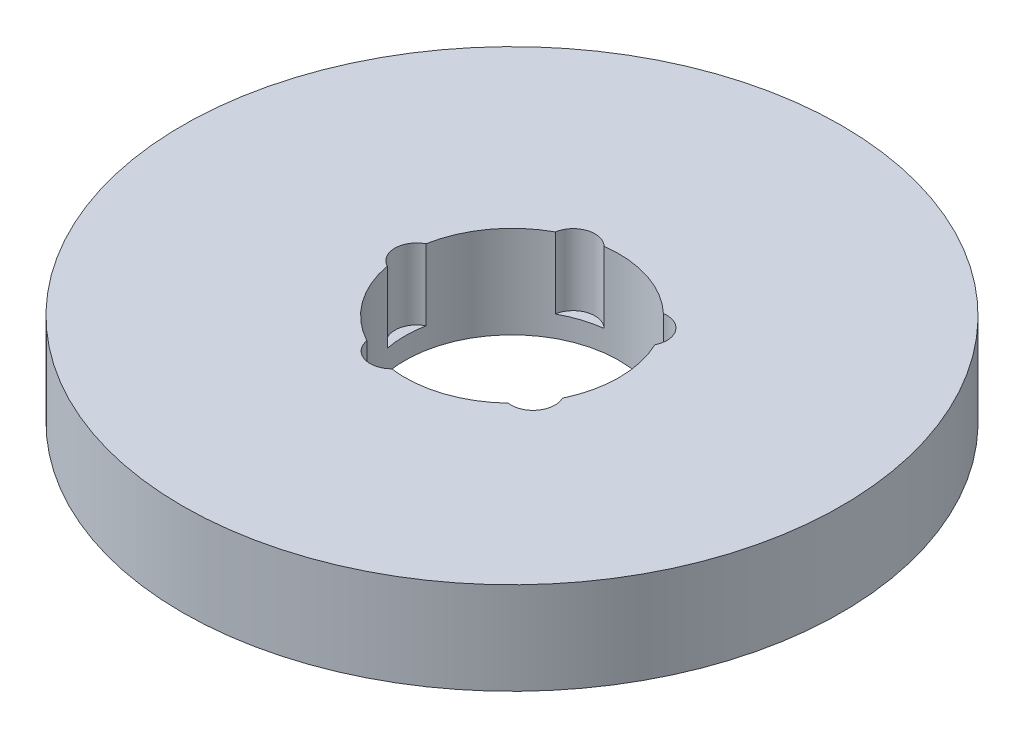
ISO-10303-21;
HEADER;
FILE_DESCRIPTION(('STEP AP214'),'2;1');
FILE_NAME('part.step','',(''),(''),'','','');
FILE_SCHEMA(('AUTOMOTIVE_DESIGN { 1 0 10303 214 1 1 1 1 }'));
ENDSEC;
DATA;
#1=APPLICATION_CONTEXT('core data for automotive mechanical design processes');
#2=APPLICATION_PROTOCOL_DEFINITION('international standard','automotive_design',2000,#1);
#3=PRODUCT_CONTEXT('',#1,'mechanical');
#4=PRODUCT('Part','Part','',(#3));
#5=PRODUCT_RELATED_PRODUCT_CATEGORY('part','',(#4));
#6=PRODUCT_DEFINITION_FORMATION('','',#4);
#7=PRODUCT_DEFINITION_CONTEXT('part definition',#1,'design');
#8=PRODUCT_DEFINITION('design','',#6,#7);
#9=PRODUCT_DEFINITION_SHAPE('','',#8);
#10=(LENGTH_UNIT() NAMED_UNIT(*) SI_UNIT(.MILLI.,.METRE.));
#11=(NAMED_UNIT(*) PLANE_ANGLE_UNIT() SI_UNIT($,.RADIAN.));
#12=(NAMED_UNIT(*) SI_UNIT($,.STERADIAN.) SOLID_ANGLE_UNIT());
#13=UNCERTAINTY_MEASURE_WITH_UNIT(LENGTH_MEASURE(1.E-05),#10,'distance_accuracy_value','');
#14=(GEOMETRIC_REPRESENTATION_CONTEXT(3) GLOBAL_UNCERTAINTY_ASSIGNED_CONTEXT((#13)) GLOBAL_UNIT_ASSIGNED_CONTEXT((#10,
#11,#12)) REPRESENTATION_CONTEXT('',''));
#15=CARTESIAN_POINT('',(0.,0.,0.));
#16=DIRECTION('',(0.,0.,1.));
#17=DIRECTION('',(1.,0.,0.));
#18=AXIS2_PLACEMENT_3D('',#15,#16,#17);
#19=CARTESIAN_POINT('',(0.,28.,0.));
#20=DIRECTION('',(0.,-1.,0.));
#21=DIRECTION('',(0.,0.,-1.));
#22=AXIS2_PLACEMENT_3D('',#19,#20,#21);
#23=CYLINDRICAL_SURFACE('',#22,100.);
#24=CARTESIAN_POINT('',(0.,28.,0.));
#25=DIRECTION('',(0.,1.,0.));
#26=DIRECTION('',(0.,0.,1.));
#27=AXIS2_PLACEMENT_3D('',#24,#25,#26);
#28=CIRCLE('',#27,100.);
#29=CARTESIAN_POINT('',(0.,28.,100.));
#30=VERTEX_POINT('',#29);
#31=EDGE_CURVE('E151',#30,#30,#28,.T.);
#32=ORIENTED_EDGE('',*,*,#31,.F.);
#33=EDGE_LOOP('',(#32));
#34=FACE_BOUND('',#33,.T.);
#35=CARTESIAN_POINT('',(0.,0.,0.));
#36=DIRECTION('',(0.,1.,0.));
#37=DIRECTION('',(0.,0.,1.));
#38=AXIS2_PLACEMENT_3D('',#35,#36,#37);
#39=CIRCLE('',#38,100.);
#40=CARTESIAN_POINT('',(0.,0.,100.));
#41=VERTEX_POINT('',#40);
#42=EDGE_CURVE('E150',#41,#41,#39,.T.);
#43=ORIENTED_EDGE('',*,*,#42,.T.);
#44=EDGE_LOOP('',(#43));
#45=FACE_BOUND('',#44,.T.);
#46=ADVANCED_FACE('F39',(#34,#45),#23,.T.);
#47=CARTESIAN_POINT('',(0.,28.,0.));
#48=DIRECTION('',(0.,1.,0.));
#49=DIRECTION('',(0.,0.,1.));
#50=AXIS2_PLACEMENT_3D('',#47,#48,#49);
#51=PLANE('',#50);
#52=CARTESIAN_POINT('',(-8.93474832553074,28.,-27.498327830289));
#53=DIRECTION('',(0.,1.,0.));
#54=DIRECTION('',(-0.95105651629515,0.,0.309016994374958));
#55=AXIS2_PLACEMENT_3D('',#52,#53,#54);
#56=CIRCLE('',#55,6.61560669939924);
#57=CARTESIAN_POINT('',(-4.29571494416497,28.,-32.2148542309053));
#58=VERTEX_POINT('',#57);
#59=CARTESIAN_POINT('',(-15.4601098288587,28.,-28.5873224363463));
#60=VERTEX_POINT('',#59);
#61=EDGE_CURVE('E196',#58,#60,#56,.T.);
#62=ORIENTED_EDGE('',*,*,#61,.F.);
#63=CARTESIAN_POINT('',(0.,28.,0.));
#64=DIRECTION('',(0.,1.,0.));
#65=DIRECTION('',(0.,0.,1.));
#66=AXIS2_PLACEMENT_3D('',#63,#64,#65);
#67=CIRCLE('',#66,32.5);
#68=CARTESIAN_POINT('',(22.4107226144973,28.,-23.537406651882));
#69=VERTEX_POINT('',#68);
#70=EDGE_CURVE('E156',#69,#58,#67,.T.);
#71=ORIENTED_EDGE('',*,*,#70,.F.);
#72=CARTESIAN_POINT('',(23.3914747971647,28.,-16.9949012329061));
#73=DIRECTION('',(0.,1.,0.));
#74=DIRECTION('',(-0.58778525229248,0.,-0.809016994374942));
#75=AXIS2_PLACEMENT_3D('',#72,#73,#74);
#76=CIRCLE('',#75,6.61560669939924);
#77=CARTESIAN_POINT('',(29.3106981170636,28.,-14.0404051184559));
#78=VERTEX_POINT('',#77);
#79=EDGE_CURVE('E254',#78,#69,#76,.T.);
#80=ORIENTED_EDGE('',*,*,#79,.F.);
#81=CARTESIAN_POINT('',(29.3106981170638,28.,14.0404051184555));
#82=VERTEX_POINT('',#81);
#83=EDGE_CURVE('E153',#82,#78,#67,.T.);
#84=ORIENTED_EDGE('',*,*,#83,.F.);
#85=CARTESIAN_POINT('',(23.391474797165,28.,16.9949012329057));
#86=DIRECTION('',(0.,1.,0.));
#87=DIRECTION('',(0.587785252292469,0.,-0.809016994374951));
#88=AXIS2_PLACEMENT_3D('',#85,#86,#87);
#89=CIRCLE('',#88,6.61560669939924);
#90=CARTESIAN_POINT('',(22.4107226144977,28.,23.5374066518816));
#91=VERTEX_POINT('',#90);
#92=EDGE_CURVE('E248',#91,#82,#89,.T.);
#93=ORIENTED_EDGE('',*,*,#92,.F.);
#94=CARTESIAN_POINT('',(-4.29571494416451,28.,32.2148542309054));
#95=VERTEX_POINT('',#94);
#96=EDGE_CURVE('E140',#95,#91,#67,.T.);
#97=ORIENTED_EDGE('',*,*,#96,.F.);
#98=CARTESIAN_POINT('',(-8.93474832553035,28.,27.4983278302892));
#99=DIRECTION('',(0.,1.,0.));
#100=DIRECTION('',(0.951056516295155,0.,0.309016994374945));
#101=AXIS2_PLACEMENT_3D('',#98,#99,#100);
#102=CIRCLE('',#101,6.61560669939924);
#103=CARTESIAN_POINT('',(-15.4601098288583,28.,28.5873224363465));
#104=VERTEX_POINT('',#103);
#105=EDGE_CURVE('E117',#104,#95,#102,.T.);
#106=ORIENTED_EDGE('',*,*,#105,.F.);
#107=CARTESIAN_POINT('',(-31.9655959585383,28.,5.86946973886722));
#108=VERTEX_POINT('',#107);
#109=EDGE_CURVE('E133',#108,#104,#67,.T.);
#110=ORIENTED_EDGE('',*,*,#109,.F.);
#111=CARTESIAN_POINT('',(-28.9134529432689,28.,0.));
#112=DIRECTION('',(0.,1.,0.));
#113=DIRECTION('',(0.,0.,1.));
#114=AXIS2_PLACEMENT_3D('',#111,#112,#113);
#115=CIRCLE('',#114,6.61560669939924);
#116=CARTESIAN_POINT('',(-31.9655959585383,28.,-5.86946973886722));
#117=VERTEX_POINT('',#116);
#118=EDGE_CURVE('E170',#117,#108,#115,.T.);
#119=ORIENTED_EDGE('',*,*,#118,.F.);
#120=EDGE_CURVE('E149',#60,#117,#67,.T.);
#121=ORIENTED_EDGE('',*,*,#120,.F.);
#122=EDGE_LOOP('',(#62,#71,#80,#84,#93,#97,#106,#110,#119,#121));
#123=FACE_BOUND('',#122,.T.);
#124=ORIENTED_EDGE('',*,*,#31,.T.);
#125=EDGE_LOOP('',(#124));
#126=FACE_BOUND('',#125,.T.);
#127=ADVANCED_FACE('F131',(#123,#126),#51,.T.);
#128=CARTESIAN_POINT('',(0.,0.,0.));
#129=DIRECTION('',(0.,1.,0.));
#130=DIRECTION('',(0.,0.,1.));
#131=AXIS2_PLACEMENT_3D('',#128,#129,#130);
#132=PLANE('',#131);
#133=CARTESIAN_POINT('',(0.,0.,0.));
#134=DIRECTION('',(0.,1.,0.));
#135=DIRECTION('',(0.,0.,1.));
#136=AXIS2_PLACEMENT_3D('',#133,#134,#135);
#137=CIRCLE('',#136,32.5);
#138=CARTESIAN_POINT('',(0.,0.,32.5));
#139=VERTEX_POINT('',#138);
#140=EDGE_CURVE('E160',#139,#139,#137,.T.);
#141=ORIENTED_EDGE('',*,*,#140,.T.);
#142=EDGE_LOOP('',(#141));
#143=FACE_BOUND('',#142,.T.);
#144=ORIENTED_EDGE('',*,*,#42,.F.);
#145=EDGE_LOOP('',(#144));
#146=FACE_BOUND('',#145,.T.);
#147=ADVANCED_FACE('F212',(#143,#146),#132,.F.);
#148=CARTESIAN_POINT('',(0.,28.,0.));
#149=DIRECTION('',(0.,-1.,0.));
#150=DIRECTION('',(0.,0.,-1.));
#151=AXIS2_PLACEMENT_3D('',#148,#149,#150);
#152=CYLINDRICAL_SURFACE('',#151,32.5);
#153=DIRECTION('',(0.,1.,0.));
#154=VECTOR('',#153,1.);
#155=CARTESIAN_POINT('',(-4.29571494416496,17.2184161531067,-32.2148542309053));
#156=LINE('',#155,#154);
#157=CARTESIAN_POINT('',(-4.29571494416497,6.4368323062135,-32.2148542309053));
#158=VERTEX_POINT('',#157);
#159=EDGE_CURVE('E11',#158,#58,#156,.T.);
#160=ORIENTED_EDGE('',*,*,#159,.F.);
#161=CARTESIAN_POINT('',(0.,6.4368323062135,0.));
#162=DIRECTION('',(0.,1.,0.));
#163=DIRECTION('',(0.,0.,1.));
#164=AXIS2_PLACEMENT_3D('',#161,#162,#163);
#165=CIRCLE('',#164,32.5);
#166=CARTESIAN_POINT('',(-15.4601098288587,6.4368323062135,-28.5873224363463));
#167=VERTEX_POINT('',#166);
#168=EDGE_CURVE('E193',#158,#167,#165,.T.);
#169=ORIENTED_EDGE('',*,*,#168,.T.);
#170=DIRECTION('',(0.,1.,0.));
#171=VECTOR('',#170,1.);
#172=CARTESIAN_POINT('',(-15.4601098288587,17.2184161531067,-28.5873224363463));
#173=LINE('',#172,#171);
#174=EDGE_CURVE('E46',#60,#167,#173,.F.);
#175=ORIENTED_EDGE('',*,*,#174,.F.);
#176=ORIENTED_EDGE('',*,*,#120,.T.);
#177=DIRECTION('',(0.,1.,0.));
#178=VECTOR('',#177,1.);
#179=CARTESIAN_POINT('',(-31.9655959585383,17.2184161531067,-5.86946973886722));
#180=LINE('',#179,#178);
#181=CARTESIAN_POINT('',(-31.9655959585383,6.4368323062135,-5.86946973886722));
#182=VERTEX_POINT('',#181);
#183=EDGE_CURVE('E174',#182,#117,#180,.T.);
#184=ORIENTED_EDGE('',*,*,#183,.F.);
#185=CARTESIAN_POINT('',(0.,6.4368323062135,0.));
#186=DIRECTION('',(0.,1.,0.));
#187=DIRECTION('',(0.,0.,1.));
#188=AXIS2_PLACEMENT_3D('',#185,#186,#187);
#189=CIRCLE('',#188,32.5);
#190=CARTESIAN_POINT('',(-31.9655959585383,6.4368323062135,5.86946973886722));
#191=VERTEX_POINT('',#190);
#192=EDGE_CURVE('E171',#182,#191,#189,.T.);
#193=ORIENTED_EDGE('',*,*,#192,.T.);
#194=DIRECTION('',(0.,1.,0.));
#195=VECTOR('',#194,1.);
#196=CARTESIAN_POINT('',(-31.9655959585383,17.2184161531067,5.86946973886722));
#197=LINE('',#196,#195);
#198=EDGE_CURVE('E148',#108,#191,#197,.F.);
#199=ORIENTED_EDGE('',*,*,#198,.F.);
#200=ORIENTED_EDGE('',*,*,#109,.T.);
#201=DIRECTION('',(0.,1.,0.));
#202=VECTOR('',#201,1.);
#203=CARTESIAN_POINT('',(-15.4601098288583,17.2184161531067,28.5873224363465));
#204=LINE('',#203,#202);
#205=CARTESIAN_POINT('',(-15.4601098288583,6.4368323062135,28.5873224363465));
#206=VERTEX_POINT('',#205);
#207=EDGE_CURVE('E111',#206,#104,#204,.T.);
#208=ORIENTED_EDGE('',*,*,#207,.F.);
#209=CARTESIAN_POINT('',(0.,6.4368323062135,0.));
#210=DIRECTION('',(0.,1.,0.));
#211=DIRECTION('',(0.,0.,1.));
#212=AXIS2_PLACEMENT_3D('',#209,#210,#211);
#213=CIRCLE('',#212,32.5);
#214=CARTESIAN_POINT('',(-4.29571494416451,6.4368323062135,32.2148542309054));
#215=VERTEX_POINT('',#214);
#216=EDGE_CURVE('E180',#206,#215,#213,.T.);
#217=ORIENTED_EDGE('',*,*,#216,.T.);
#218=DIRECTION('',(0.,1.,0.));
#219=VECTOR('',#218,1.);
#220=CARTESIAN_POINT('',(-4.2957149441645,17.2184161531067,32.2148542309054));
#221=LINE('',#220,#219);
#222=EDGE_CURVE('E124',#95,#215,#221,.F.);
#223=ORIENTED_EDGE('',*,*,#222,.F.);
#224=ORIENTED_EDGE('',*,*,#96,.T.);
#225=DIRECTION('',(0.,1.,0.));
#226=VECTOR('',#225,1.);
#227=CARTESIAN_POINT('',(22.4107226144977,17.2184161531067,23.5374066518816));
#228=LINE('',#227,#226);
#229=CARTESIAN_POINT('',(22.4107226144977,6.4368323062135,23.5374066518816));
#230=VERTEX_POINT('',#229);
#231=EDGE_CURVE('E183',#230,#91,#228,.T.);
#232=ORIENTED_EDGE('',*,*,#231,.F.);
#233=CARTESIAN_POINT('',(0.,6.4368323062135,0.));
#234=DIRECTION('',(0.,1.,0.));
#235=DIRECTION('',(0.,0.,1.));
#236=AXIS2_PLACEMENT_3D('',#233,#234,#235);
#237=CIRCLE('',#236,32.5);
#238=CARTESIAN_POINT('',(29.3106981170638,6.4368323062135,14.0404051184555));
#239=VERTEX_POINT('',#238);
#240=EDGE_CURVE('E123',#230,#239,#237,.T.);
#241=ORIENTED_EDGE('',*,*,#240,.T.);
#242=DIRECTION('',(0.,1.,0.));
#243=VECTOR('',#242,1.);
#244=CARTESIAN_POINT('',(29.3106981170638,17.2184161531067,14.0404051184555));
#245=LINE('',#244,#243);
#246=EDGE_CURVE('E185',#82,#239,#245,.F.);
#247=ORIENTED_EDGE('',*,*,#246,.F.);
#248=ORIENTED_EDGE('',*,*,#83,.T.);
#249=DIRECTION('',(0.,1.,0.));
#250=VECTOR('',#249,1.);
#251=CARTESIAN_POINT('',(29.3106981170636,17.2184161531067,-14.0404051184559));
#252=LINE('',#251,#250);
#253=CARTESIAN_POINT('',(29.3106981170636,6.4368323062135,-14.0404051184559));
#254=VERTEX_POINT('',#253);
#255=EDGE_CURVE('E195',#254,#78,#252,.T.);
#256=ORIENTED_EDGE('',*,*,#255,.F.);
#257=CARTESIAN_POINT('',(0.,6.4368323062135,0.));
#258=DIRECTION('',(0.,1.,0.));
#259=DIRECTION('',(0.,0.,1.));
#260=AXIS2_PLACEMENT_3D('',#257,#258,#259);
#261=CIRCLE('',#260,32.5);
#262=CARTESIAN_POINT('',(22.4107226144973,6.4368323062135,-23.537406651882));
#263=VERTEX_POINT('',#262);
#264=EDGE_CURVE('E190',#254,#263,#261,.T.);
#265=ORIENTED_EDGE('',*,*,#264,.T.);
#266=DIRECTION('',(0.,1.,0.));
#267=VECTOR('',#266,1.);
#268=CARTESIAN_POINT('',(22.4107226144973,17.2184161531067,-23.537406651882));
#269=LINE('',#268,#267);
#270=EDGE_CURVE('E189',#69,#263,#269,.F.);
#271=ORIENTED_EDGE('',*,*,#270,.F.);
#272=ORIENTED_EDGE('',*,*,#70,.T.);
#273=EDGE_LOOP('',(#160,#169,#175,#176,#184,#193,#199,#200,#208,#217,#223,#224,#232,#241,#247,
#248,#256,#265,#271,#272));
#274=FACE_BOUND('',#273,.T.);
#275=ORIENTED_EDGE('',*,*,#140,.F.);
#276=EDGE_LOOP('',(#275));
#277=FACE_BOUND('',#276,.T.);
#278=ADVANCED_FACE('F142',(#274,#277),#152,.F.);
#279=CARTESIAN_POINT('',(-28.9134529432689,6.4368323062135,0.));
#280=DIRECTION('',(0.,1.,0.));
#281=DIRECTION('',(0.,0.,1.));
#282=AXIS2_PLACEMENT_3D('',#279,#280,#281);
#283=CYLINDRICAL_SURFACE('',#282,6.61560669939924);
#284=ORIENTED_EDGE('',*,*,#183,.T.);
#285=ORIENTED_EDGE('',*,*,#118,.T.);
#286=ORIENTED_EDGE('',*,*,#198,.T.);
#287=CARTESIAN_POINT('',(-28.9134529432689,6.4368323062135,0.));
#288=DIRECTION('',(0.,1.,0.));
#289=DIRECTION('',(0.,0.,1.));
#290=AXIS2_PLACEMENT_3D('',#287,#288,#289);
#291=CIRCLE('',#290,6.61560669939924);
#292=EDGE_CURVE('E163',#182,#191,#291,.T.);
#293=ORIENTED_EDGE('',*,*,#292,.F.);
#294=EDGE_LOOP('',(#284,#285,#286,#293));
#295=FACE_BOUND('',#294,.T.);
#296=ADVANCED_FACE('F221',(#295),#283,.F.);
#297=CARTESIAN_POINT('',(-28.9134529432689,6.4368323062135,0.));
#298=DIRECTION('',(0.,1.,0.));
#299=DIRECTION('',(0.,0.,1.));
#300=AXIS2_PLACEMENT_3D('',#297,#298,#299);
#301=PLANE('',#300);
#302=ORIENTED_EDGE('',*,*,#292,.T.);
#303=ORIENTED_EDGE('',*,*,#192,.F.);
#304=EDGE_LOOP('',(#302,#303));
#305=FACE_BOUND('',#304,.T.);
#306=ADVANCED_FACE('F227',(#305),#301,.T.);
#307=CARTESIAN_POINT('',(-8.93474832553035,6.4368323062135,27.4983278302892));
#308=DIRECTION('',(0.,1.,0.));
#309=DIRECTION('',(0.,0.,1.));
#310=AXIS2_PLACEMENT_3D('',#307,#308,#309);
#311=CYLINDRICAL_SURFACE('',#310,6.61560669939924);
#312=ORIENTED_EDGE('',*,*,#207,.T.);
#313=ORIENTED_EDGE('',*,*,#105,.T.);
#314=ORIENTED_EDGE('',*,*,#222,.T.);
#315=CARTESIAN_POINT('',(-8.93474832553035,6.4368323062135,27.4983278302892));
#316=DIRECTION('',(0.,1.,0.));
#317=DIRECTION('',(0.951056516295155,0.,0.309016994374945));
#318=AXIS2_PLACEMENT_3D('',#315,#316,#317);
#319=CIRCLE('',#318,6.61560669939924);
#320=EDGE_CURVE('E119',#206,#215,#319,.T.);
#321=ORIENTED_EDGE('',*,*,#320,.F.);
#322=EDGE_LOOP('',(#312,#313,#314,#321));
#323=FACE_BOUND('',#322,.T.);
#324=ADVANCED_FACE('F116',(#323),#311,.F.);
#325=CARTESIAN_POINT('',(-8.93474832553035,6.4368323062135,27.4983278302892));
#326=DIRECTION('',(0.,1.,0.));
#327=DIRECTION('',(0.951056516295155,0.,0.309016994374945));
#328=AXIS2_PLACEMENT_3D('',#325,#326,#327);
#329=PLANE('',#328);
#330=ORIENTED_EDGE('',*,*,#320,.T.);
#331=ORIENTED_EDGE('',*,*,#216,.F.);
#332=EDGE_LOOP('',(#330,#331));
#333=FACE_BOUND('',#332,.T.);
#334=ADVANCED_FACE('F234',(#333),#329,.T.);
#335=CARTESIAN_POINT('',(23.391474797165,6.4368323062135,16.9949012329057));
#336=DIRECTION('',(0.,1.,0.));
#337=DIRECTION('',(0.,0.,1.));
#338=AXIS2_PLACEMENT_3D('',#335,#336,#337);
#339=CYLINDRICAL_SURFACE('',#338,6.61560669939924);
#340=ORIENTED_EDGE('',*,*,#231,.T.);
#341=ORIENTED_EDGE('',*,*,#92,.T.);
#342=ORIENTED_EDGE('',*,*,#246,.T.);
#343=CARTESIAN_POINT('',(23.391474797165,6.4368323062135,16.9949012329057));
#344=DIRECTION('',(0.,1.,0.));
#345=DIRECTION('',(0.587785252292469,0.,-0.809016994374951));
#346=AXIS2_PLACEMENT_3D('',#343,#344,#345);
#347=CIRCLE('',#346,6.61560669939924);
#348=EDGE_CURVE('E137',#230,#239,#347,.T.);
#349=ORIENTED_EDGE('',*,*,#348,.F.);
#350=EDGE_LOOP('',(#340,#341,#342,#349));
#351=FACE_BOUND('',#350,.T.);
#352=ADVANCED_FACE('F240',(#351),#339,.F.);
#353=CARTESIAN_POINT('',(23.391474797165,6.4368323062135,16.9949012329057));
#354=DIRECTION('',(0.,1.,0.));
#355=DIRECTION('',(0.587785252292469,0.,-0.809016994374951));
#356=AXIS2_PLACEMENT_3D('',#353,#354,#355);
#357=PLANE('',#356);
#358=ORIENTED_EDGE('',*,*,#348,.T.);
#359=ORIENTED_EDGE('',*,*,#240,.F.);
#360=EDGE_LOOP('',(#358,#359));
#361=FACE_BOUND('',#360,.T.);
#362=ADVANCED_FACE('F245',(#361),#357,.T.);
#363=CARTESIAN_POINT('',(23.3914747971647,6.4368323062135,-16.9949012329061));
#364=DIRECTION('',(0.,1.,0.));
#365=DIRECTION('',(0.,0.,1.));
#366=AXIS2_PLACEMENT_3D('',#363,#364,#365);
#367=CYLINDRICAL_SURFACE('',#366,6.61560669939924);
#368=ORIENTED_EDGE('',*,*,#255,.T.);
#369=ORIENTED_EDGE('',*,*,#79,.T.);
#370=ORIENTED_EDGE('',*,*,#270,.T.);
#371=CARTESIAN_POINT('',(23.3914747971647,6.4368323062135,-16.9949012329061));
#372=DIRECTION('',(0.,1.,0.));
#373=DIRECTION('',(-0.58778525229248,0.,-0.809016994374942));
#374=AXIS2_PLACEMENT_3D('',#371,#372,#373);
#375=CIRCLE('',#374,6.61560669939924);
#376=EDGE_CURVE('E56',#254,#263,#375,.T.);
#377=ORIENTED_EDGE('',*,*,#376,.F.);
#378=EDGE_LOOP('',(#368,#369,#370,#377));
#379=FACE_BOUND('',#378,.T.);
#380=ADVANCED_FACE('F264',(#379),#367,.F.);
#381=CARTESIAN_POINT('',(23.3914747971647,6.4368323062135,-16.9949012329061));
#382=DIRECTION('',(0.,1.,0.));
#383=DIRECTION('',(-0.58778525229248,0.,-0.809016994374942));
#384=AXIS2_PLACEMENT_3D('',#381,#382,#383);
#385=PLANE('',#384);
#386=ORIENTED_EDGE('',*,*,#376,.T.);
#387=ORIENTED_EDGE('',*,*,#264,.F.);
#388=EDGE_LOOP('',(#386,#387));
#389=FACE_BOUND('',#388,.T.);
#390=ADVANCED_FACE('F202',(#389),#385,.T.);
#391=CARTESIAN_POINT('',(-8.93474832553074,6.4368323062135,-27.498327830289));
#392=DIRECTION('',(0.,1.,0.));
#393=DIRECTION('',(0.,0.,1.));
#394=AXIS2_PLACEMENT_3D('',#391,#392,#393);
#395=CYLINDRICAL_SURFACE('',#394,6.61560669939924);
#396=ORIENTED_EDGE('',*,*,#159,.T.);
#397=ORIENTED_EDGE('',*,*,#61,.T.);
#398=ORIENTED_EDGE('',*,*,#174,.T.);
#399=CARTESIAN_POINT('',(-8.93474832553074,6.4368323062135,-27.498327830289));
#400=DIRECTION('',(0.,1.,0.));
#401=DIRECTION('',(-0.95105651629515,0.,0.309016994374958));
#402=AXIS2_PLACEMENT_3D('',#399,#400,#401);
#403=CIRCLE('',#402,6.61560669939924);
#404=EDGE_CURVE('E55',#158,#167,#403,.T.);
#405=ORIENTED_EDGE('',*,*,#404,.F.);
#406=EDGE_LOOP('',(#396,#397,#398,#405));
#407=FACE_BOUND('',#406,.T.);
#408=ADVANCED_FACE('F197',(#407),#395,.F.);
#409=CARTESIAN_POINT('',(-8.93474832553074,6.4368323062135,-27.498327830289));
#410=DIRECTION('',(0.,1.,0.));
#411=DIRECTION('',(-0.95105651629515,0.,0.309016994374958));
#412=AXIS2_PLACEMENT_3D('',#409,#410,#411);
#413=PLANE('',#412);
#414=ORIENTED_EDGE('',*,*,#404,.T.);
#415=ORIENTED_EDGE('',*,*,#168,.F.);
#416=EDGE_LOOP('',(#414,#415));
#417=FACE_BOUND('',#416,.T.);
#418=ADVANCED_FACE('F200',(#417),#413,.T.);
#419=CLOSED_SHELL('',(#46,#127,#147,#278,#296,#306,#324,#334,#352,#362,#380,#390,#408,#418));
#420=MANIFOLD_SOLID_BREP('B2',#419);
#421=ADVANCED_BREP_SHAPE_REPRESENTATION('',(#18,#420),#14);
#422=SHAPE_DEFINITION_REPRESENTATION(#9,#421);
ENDSEC;
END-ISO-10303-21;
